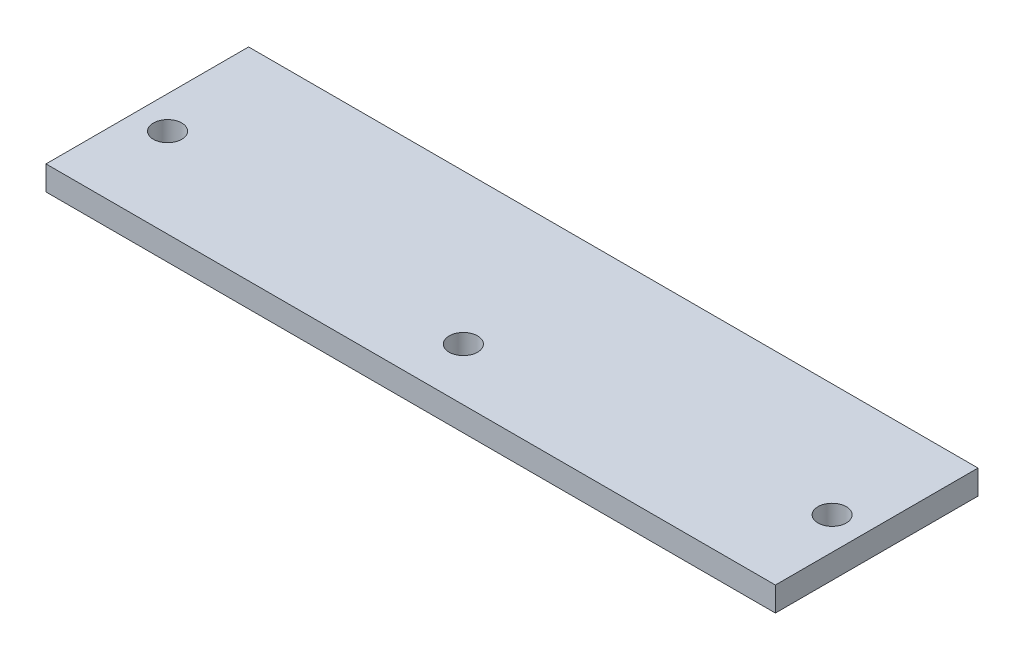
ISO-10303-21;
HEADER;
FILE_DESCRIPTION(('STEP AP214'),'2;1');
FILE_NAME('part.step','',(''),(''),'','','');
FILE_SCHEMA(('AUTOMOTIVE_DESIGN { 1 0 10303 214 1 1 1 1 }'));
ENDSEC;
DATA;
#1=APPLICATION_CONTEXT('core data for automotive mechanical design processes');
#2=APPLICATION_PROTOCOL_DEFINITION('international standard','automotive_design',2000,#1);
#3=PRODUCT_CONTEXT('',#1,'mechanical');
#4=PRODUCT('Part','Part','',(#3));
#5=PRODUCT_RELATED_PRODUCT_CATEGORY('part','',(#4));
#6=PRODUCT_DEFINITION_FORMATION('','',#4);
#7=PRODUCT_DEFINITION_CONTEXT('part definition',#1,'design');
#8=PRODUCT_DEFINITION('design','',#6,#7);
#9=PRODUCT_DEFINITION_SHAPE('','',#8);
#10=(LENGTH_UNIT() NAMED_UNIT(*) SI_UNIT(.MILLI.,.METRE.));
#11=(NAMED_UNIT(*) PLANE_ANGLE_UNIT() SI_UNIT($,.RADIAN.));
#12=(NAMED_UNIT(*) SI_UNIT($,.STERADIAN.) SOLID_ANGLE_UNIT());
#13=UNCERTAINTY_MEASURE_WITH_UNIT(LENGTH_MEASURE(1.E-05),#10,'distance_accuracy_value','');
#14=(GEOMETRIC_REPRESENTATION_CONTEXT(3) GLOBAL_UNCERTAINTY_ASSIGNED_CONTEXT((#13)) GLOBAL_UNIT_ASSIGNED_CONTEXT((#10,
#11,#12)) REPRESENTATION_CONTEXT('',''));
#15=CARTESIAN_POINT('',(0.,0.,0.));
#16=DIRECTION('',(0.,0.,1.));
#17=DIRECTION('',(1.,0.,0.));
#18=AXIS2_PLACEMENT_3D('',#15,#16,#17);
#19=CARTESIAN_POINT('',(0.,3.,0.));
#20=DIRECTION('',(0.,1.,0.));
#21=DIRECTION('',(0.,0.,1.));
#22=AXIS2_PLACEMENT_3D('',#19,#20,#21);
#23=PLANE('',#22);
#24=CARTESIAN_POINT('',(41.,3.,1.49999999999998));
#25=DIRECTION('',(0.,1.,0.));
#26=DIRECTION('',(0.,0.,1.));
#27=AXIS2_PLACEMENT_3D('',#24,#25,#26);
#28=CIRCLE('',#27,1.75);
#29=CARTESIAN_POINT('',(41.,3.,3.24999999999998));
#30=VERTEX_POINT('',#29);
#31=EDGE_CURVE('E121',#30,#30,#28,.T.);
#32=ORIENTED_EDGE('',*,*,#31,.F.);
#33=EDGE_LOOP('',(#32));
#34=FACE_BOUND('',#33,.T.);
#35=DIRECTION('',(0.,0.,-1.));
#36=VECTOR('',#35,1.);
#37=CARTESIAN_POINT('',(45.,3.,-12.5));
#38=LINE('',#37,#36);
#39=CARTESIAN_POINT('',(45.,3.,12.5));
#40=VERTEX_POINT('',#39);
#41=CARTESIAN_POINT('',(45.,3.,-12.5));
#42=VERTEX_POINT('',#41);
#43=EDGE_CURVE('E91',#40,#42,#38,.T.);
#44=ORIENTED_EDGE('',*,*,#43,.T.);
#45=DIRECTION('',(-1.,0.,0.));
#46=VECTOR('',#45,1.);
#47=CARTESIAN_POINT('',(-45.,3.,-12.5));
#48=LINE('',#47,#46);
#49=CARTESIAN_POINT('',(-45.,3.,-12.5));
#50=VERTEX_POINT('',#49);
#51=EDGE_CURVE('E86',#42,#50,#48,.T.);
#52=ORIENTED_EDGE('',*,*,#51,.T.);
#53=DIRECTION('',(0.,0.,1.));
#54=VECTOR('',#53,1.);
#55=CARTESIAN_POINT('',(-45.,3.,-12.5));
#56=LINE('',#55,#54);
#57=CARTESIAN_POINT('',(-45.,3.,12.5));
#58=VERTEX_POINT('',#57);
#59=EDGE_CURVE('E89',#50,#58,#56,.T.);
#60=ORIENTED_EDGE('',*,*,#59,.T.);
#61=DIRECTION('',(1.,0.,0.));
#62=VECTOR('',#61,1.);
#63=CARTESIAN_POINT('',(-45.,3.,12.5));
#64=LINE('',#63,#62);
#65=EDGE_CURVE('E56',#58,#40,#64,.T.);
#66=ORIENTED_EDGE('',*,*,#65,.T.);
#67=EDGE_LOOP('',(#44,#52,#60,#66));
#68=FACE_BOUND('',#67,.T.);
#69=CARTESIAN_POINT('',(-41.,3.,1.5));
#70=DIRECTION('',(0.,1.,0.));
#71=DIRECTION('',(0.,0.,1.));
#72=AXIS2_PLACEMENT_3D('',#69,#70,#71);
#73=CIRCLE('',#72,1.75);
#74=CARTESIAN_POINT('',(-41.,3.,3.25));
#75=VERTEX_POINT('',#74);
#76=EDGE_CURVE('E106',#75,#75,#73,.T.);
#77=ORIENTED_EDGE('',*,*,#76,.F.);
#78=EDGE_LOOP('',(#77));
#79=FACE_BOUND('',#78,.T.);
#80=CARTESIAN_POINT('',(0.,3.,6.));
#81=DIRECTION('',(0.,1.,0.));
#82=DIRECTION('',(0.,0.,1.));
#83=AXIS2_PLACEMENT_3D('',#80,#81,#82);
#84=CIRCLE('',#83,1.75);
#85=CARTESIAN_POINT('',(0.,3.,7.75));
#86=VERTEX_POINT('',#85);
#87=EDGE_CURVE('E127',#86,#86,#84,.T.);
#88=ORIENTED_EDGE('',*,*,#87,.F.);
#89=EDGE_LOOP('',(#88));
#90=FACE_BOUND('',#89,.T.);
#91=ADVANCED_FACE('F39',(#34,#68,#79,#90),#23,.T.);
#92=CARTESIAN_POINT('',(0.,0.,0.));
#93=DIRECTION('',(0.,1.,0.));
#94=DIRECTION('',(0.,0.,1.));
#95=AXIS2_PLACEMENT_3D('',#92,#93,#94);
#96=PLANE('',#95);
#97=DIRECTION('',(0.,0.,-1.));
#98=VECTOR('',#97,1.);
#99=CARTESIAN_POINT('',(45.,0.,-12.5));
#100=LINE('',#99,#98);
#101=CARTESIAN_POINT('',(45.,0.,12.5));
#102=VERTEX_POINT('',#101);
#103=CARTESIAN_POINT('',(45.,0.,-12.5));
#104=VERTEX_POINT('',#103);
#105=EDGE_CURVE('E103',#102,#104,#100,.T.);
#106=ORIENTED_EDGE('',*,*,#105,.F.);
#107=DIRECTION('',(1.,0.,0.));
#108=VECTOR('',#107,1.);
#109=CARTESIAN_POINT('',(-45.,0.,12.5));
#110=LINE('',#109,#108);
#111=CARTESIAN_POINT('',(-45.,0.,12.5));
#112=VERTEX_POINT('',#111);
#113=EDGE_CURVE('E79',#112,#102,#110,.T.);
#114=ORIENTED_EDGE('',*,*,#113,.F.);
#115=DIRECTION('',(0.,0.,1.));
#116=VECTOR('',#115,1.);
#117=CARTESIAN_POINT('',(-45.,0.,-12.5));
#118=LINE('',#117,#116);
#119=CARTESIAN_POINT('',(-45.,0.,-12.5));
#120=VERTEX_POINT('',#119);
#121=EDGE_CURVE('E73',#120,#112,#118,.T.);
#122=ORIENTED_EDGE('',*,*,#121,.F.);
#123=DIRECTION('',(-1.,0.,0.));
#124=VECTOR('',#123,1.);
#125=CARTESIAN_POINT('',(-45.,0.,-12.5));
#126=LINE('',#125,#124);
#127=EDGE_CURVE('E95',#104,#120,#126,.T.);
#128=ORIENTED_EDGE('',*,*,#127,.F.);
#129=EDGE_LOOP('',(#106,#114,#122,#128));
#130=FACE_BOUND('',#129,.T.);
#131=CARTESIAN_POINT('',(-41.,0.,1.5));
#132=DIRECTION('',(0.,1.,0.));
#133=DIRECTION('',(0.,0.,1.));
#134=AXIS2_PLACEMENT_3D('',#131,#132,#133);
#135=CIRCLE('',#134,1.75);
#136=CARTESIAN_POINT('',(-41.,0.,3.25));
#137=VERTEX_POINT('',#136);
#138=EDGE_CURVE('E118',#137,#137,#135,.T.);
#139=ORIENTED_EDGE('',*,*,#138,.T.);
#140=EDGE_LOOP('',(#139));
#141=FACE_BOUND('',#140,.T.);
#142=CARTESIAN_POINT('',(41.,0.,1.49999999999998));
#143=DIRECTION('',(0.,1.,0.));
#144=DIRECTION('',(0.,0.,1.));
#145=AXIS2_PLACEMENT_3D('',#142,#143,#144);
#146=CIRCLE('',#145,1.75);
#147=CARTESIAN_POINT('',(41.,0.,3.24999999999998));
#148=VERTEX_POINT('',#147);
#149=EDGE_CURVE('E124',#148,#148,#146,.T.);
#150=ORIENTED_EDGE('',*,*,#149,.T.);
#151=EDGE_LOOP('',(#150));
#152=FACE_BOUND('',#151,.T.);
#153=CARTESIAN_POINT('',(0.,0.,6.));
#154=DIRECTION('',(0.,1.,0.));
#155=DIRECTION('',(0.,0.,1.));
#156=AXIS2_PLACEMENT_3D('',#153,#154,#155);
#157=CIRCLE('',#156,1.75);
#158=CARTESIAN_POINT('',(0.,0.,7.75));
#159=VERTEX_POINT('',#158);
#160=EDGE_CURVE('E130',#159,#159,#157,.T.);
#161=ORIENTED_EDGE('',*,*,#160,.T.);
#162=EDGE_LOOP('',(#161));
#163=FACE_BOUND('',#162,.T.);
#164=ADVANCED_FACE('F114',(#130,#141,#152,#163),#96,.F.);
#165=CARTESIAN_POINT('',(45.,3.,-12.5));
#166=DIRECTION('',(-1.,0.,0.));
#167=DIRECTION('',(0.,0.,1.));
#168=AXIS2_PLACEMENT_3D('',#165,#166,#167);
#169=PLANE('',#168);
#170=ORIENTED_EDGE('',*,*,#105,.T.);
#171=DIRECTION('',(0.,-1.,0.));
#172=VECTOR('',#171,1.);
#173=CARTESIAN_POINT('',(45.,3.,-12.5));
#174=LINE('',#173,#172);
#175=EDGE_CURVE('E11',#42,#104,#174,.T.);
#176=ORIENTED_EDGE('',*,*,#175,.F.);
#177=ORIENTED_EDGE('',*,*,#43,.F.);
#178=DIRECTION('',(0.,-1.,0.));
#179=VECTOR('',#178,1.);
#180=CARTESIAN_POINT('',(45.,3.,12.5));
#181=LINE('',#180,#179);
#182=EDGE_CURVE('E99',#40,#102,#181,.T.);
#183=ORIENTED_EDGE('',*,*,#182,.T.);
#184=EDGE_LOOP('',(#170,#176,#177,#183));
#185=FACE_BOUND('',#184,.T.);
#186=ADVANCED_FACE('F41',(#185),#169,.F.);
#187=CARTESIAN_POINT('',(-45.,3.,-12.5));
#188=DIRECTION('',(0.,0.,1.));
#189=DIRECTION('',(1.,0.,0.));
#190=AXIS2_PLACEMENT_3D('',#187,#188,#189);
#191=PLANE('',#190);
#192=ORIENTED_EDGE('',*,*,#127,.T.);
#193=DIRECTION('',(0.,-1.,0.));
#194=VECTOR('',#193,1.);
#195=CARTESIAN_POINT('',(-45.,3.,-12.5));
#196=LINE('',#195,#194);
#197=EDGE_CURVE('E48',#50,#120,#196,.T.);
#198=ORIENTED_EDGE('',*,*,#197,.F.);
#199=ORIENTED_EDGE('',*,*,#51,.F.);
#200=ORIENTED_EDGE('',*,*,#175,.T.);
#201=EDGE_LOOP('',(#192,#198,#199,#200));
#202=FACE_BOUND('',#201,.T.);
#203=ADVANCED_FACE('F94',(#202),#191,.F.);
#204=CARTESIAN_POINT('',(-45.,3.,-12.5));
#205=DIRECTION('',(1.,0.,0.));
#206=DIRECTION('',(0.,0.,-1.));
#207=AXIS2_PLACEMENT_3D('',#204,#205,#206);
#208=PLANE('',#207);
#209=ORIENTED_EDGE('',*,*,#121,.T.);
#210=DIRECTION('',(0.,-1.,0.));
#211=VECTOR('',#210,1.);
#212=CARTESIAN_POINT('',(-45.,3.,12.5));
#213=LINE('',#212,#211);
#214=EDGE_CURVE('E96',#58,#112,#213,.T.);
#215=ORIENTED_EDGE('',*,*,#214,.F.);
#216=ORIENTED_EDGE('',*,*,#59,.F.);
#217=ORIENTED_EDGE('',*,*,#197,.T.);
#218=EDGE_LOOP('',(#209,#215,#216,#217));
#219=FACE_BOUND('',#218,.T.);
#220=ADVANCED_FACE('F97',(#219),#208,.F.);
#221=CARTESIAN_POINT('',(-45.,3.,12.5));
#222=DIRECTION('',(0.,0.,-1.));
#223=DIRECTION('',(-1.,0.,0.));
#224=AXIS2_PLACEMENT_3D('',#221,#222,#223);
#225=PLANE('',#224);
#226=ORIENTED_EDGE('',*,*,#113,.T.);
#227=ORIENTED_EDGE('',*,*,#182,.F.);
#228=ORIENTED_EDGE('',*,*,#65,.F.);
#229=ORIENTED_EDGE('',*,*,#214,.T.);
#230=EDGE_LOOP('',(#226,#227,#228,#229));
#231=FACE_BOUND('',#230,.T.);
#232=ADVANCED_FACE('F111',(#231),#225,.F.);
#233=CARTESIAN_POINT('',(-41.,3.,1.5));
#234=DIRECTION('',(0.,-1.,0.));
#235=DIRECTION('',(0.,0.,-1.));
#236=AXIS2_PLACEMENT_3D('',#233,#234,#235);
#237=CYLINDRICAL_SURFACE('',#236,1.75);
#238=ORIENTED_EDGE('',*,*,#76,.T.);
#239=EDGE_LOOP('',(#238));
#240=FACE_BOUND('',#239,.T.);
#241=ORIENTED_EDGE('',*,*,#138,.F.);
#242=EDGE_LOOP('',(#241));
#243=FACE_BOUND('',#242,.T.);
#244=ADVANCED_FACE('F148',(#240,#243),#237,.F.);
#245=CARTESIAN_POINT('',(41.,3.,1.49999999999998));
#246=DIRECTION('',(0.,-1.,0.));
#247=DIRECTION('',(0.,0.,-1.));
#248=AXIS2_PLACEMENT_3D('',#245,#246,#247);
#249=CYLINDRICAL_SURFACE('',#248,1.75);
#250=ORIENTED_EDGE('',*,*,#31,.T.);
#251=EDGE_LOOP('',(#250));
#252=FACE_BOUND('',#251,.T.);
#253=ORIENTED_EDGE('',*,*,#149,.F.);
#254=EDGE_LOOP('',(#253));
#255=FACE_BOUND('',#254,.T.);
#256=ADVANCED_FACE('F193',(#252,#255),#249,.F.);
#257=CARTESIAN_POINT('',(0.,3.,6.));
#258=DIRECTION('',(0.,-1.,0.));
#259=DIRECTION('',(0.,0.,-1.));
#260=AXIS2_PLACEMENT_3D('',#257,#258,#259);
#261=CYLINDRICAL_SURFACE('',#260,1.75);
#262=ORIENTED_EDGE('',*,*,#87,.T.);
#263=EDGE_LOOP('',(#262));
#264=FACE_BOUND('',#263,.T.);
#265=ORIENTED_EDGE('',*,*,#160,.F.);
#266=EDGE_LOOP('',(#265));
#267=FACE_BOUND('',#266,.T.);
#268=ADVANCED_FACE('F136',(#264,#267),#261,.F.);
#269=CLOSED_SHELL('',(#91,#164,#186,#203,#220,#232,#244,#256,#268));
#270=MANIFOLD_SOLID_BREP('B2',#269);
#271=ADVANCED_BREP_SHAPE_REPRESENTATION('',(#18,#270),#14);
#272=SHAPE_DEFINITION_REPRESENTATION(#9,#271);
ENDSEC;
END-ISO-10303-21;
